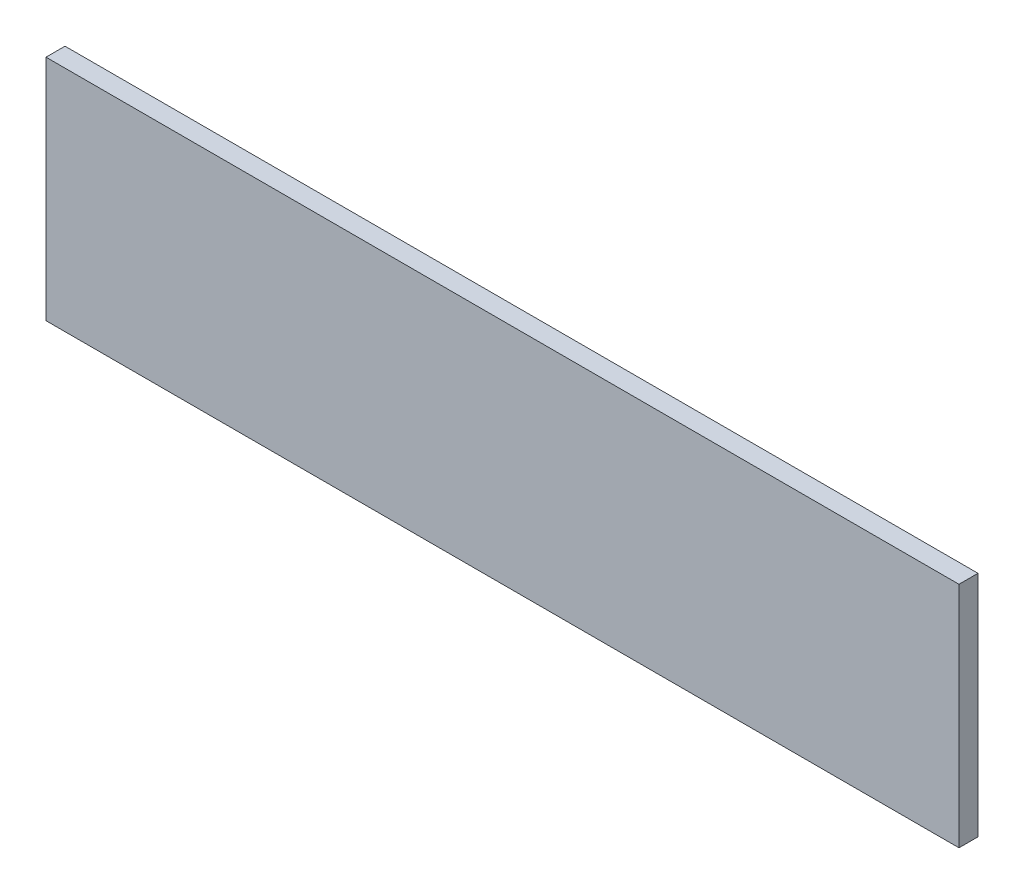
ISO-10303-21;
HEADER;
FILE_DESCRIPTION(('STEP AP214'),'2;1');
FILE_NAME('part.step','',(''),(''),'','','');
FILE_SCHEMA(('AUTOMOTIVE_DESIGN { 1 0 10303 214 1 1 1 1 }'));
ENDSEC;
DATA;
#1=APPLICATION_CONTEXT('core data for automotive mechanical design processes');
#2=APPLICATION_PROTOCOL_DEFINITION('international standard','automotive_design',2000,#1);
#3=PRODUCT_CONTEXT('',#1,'mechanical');
#4=PRODUCT('Part','Part','',(#3));
#5=PRODUCT_RELATED_PRODUCT_CATEGORY('part','',(#4));
#6=PRODUCT_DEFINITION_FORMATION('','',#4);
#7=PRODUCT_DEFINITION_CONTEXT('part definition',#1,'design');
#8=PRODUCT_DEFINITION('design','',#6,#7);
#9=PRODUCT_DEFINITION_SHAPE('','',#8);
#10=(LENGTH_UNIT() NAMED_UNIT(*) SI_UNIT(.MILLI.,.METRE.));
#11=(NAMED_UNIT(*) PLANE_ANGLE_UNIT() SI_UNIT($,.RADIAN.));
#12=(NAMED_UNIT(*) SI_UNIT($,.STERADIAN.) SOLID_ANGLE_UNIT());
#13=UNCERTAINTY_MEASURE_WITH_UNIT(LENGTH_MEASURE(1.E-05),#10,'distance_accuracy_value','');
#14=(GEOMETRIC_REPRESENTATION_CONTEXT(3) GLOBAL_UNCERTAINTY_ASSIGNED_CONTEXT((#13)) GLOBAL_UNIT_ASSIGNED_CONTEXT((#10,
#11,#12)) REPRESENTATION_CONTEXT('',''));
#15=CARTESIAN_POINT('',(0.,0.,0.));
#16=DIRECTION('',(0.,0.,1.));
#17=DIRECTION('',(1.,0.,0.));
#18=AXIS2_PLACEMENT_3D('',#15,#16,#17);
#19=CARTESIAN_POINT('',(-395.555057622941,0.,38.1));
#20=DIRECTION('',(0.,-1.,0.));
#21=DIRECTION('',(0.,0.,-1.));
#22=AXIS2_PLACEMENT_3D('',#19,#20,#21);
#23=PLANE('',#22);
#24=DIRECTION('',(-1.,0.,0.));
#25=VECTOR('',#24,1.);
#26=CARTESIAN_POINT('',(-395.555057622941,0.,0.));
#27=LINE('',#26,#25);
#28=CARTESIAN_POINT('',(0.,0.,0.));
#29=VERTEX_POINT('',#28);
#30=CARTESIAN_POINT('',(-1828.8,-1.66533453693773E-13,0.));
#31=VERTEX_POINT('',#30);
#32=EDGE_CURVE('E101',#29,#31,#27,.T.);
#33=ORIENTED_EDGE('',*,*,#32,.F.);
#34=DIRECTION('',(0.,0.,-1.));
#35=VECTOR('',#34,1.);
#36=CARTESIAN_POINT('',(0.,0.,38.1));
#37=LINE('',#36,#35);
#38=CARTESIAN_POINT('',(0.,0.,38.1));
#39=VERTEX_POINT('',#38);
#40=EDGE_CURVE('E10',#39,#29,#37,.T.);
#41=ORIENTED_EDGE('',*,*,#40,.F.);
#42=DIRECTION('',(-1.,0.,0.));
#43=VECTOR('',#42,1.);
#44=CARTESIAN_POINT('',(-395.555057622941,0.,38.1));
#45=LINE('',#44,#43);
#46=CARTESIAN_POINT('',(-1828.8,-1.66533453693773E-13,38.1));
#47=VERTEX_POINT('',#46);
#48=EDGE_CURVE('E79',#39,#47,#45,.T.);
#49=ORIENTED_EDGE('',*,*,#48,.T.);
#50=DIRECTION('',(0.,0.,-1.));
#51=VECTOR('',#50,1.);
#52=CARTESIAN_POINT('',(-1828.8,-1.66533453693773E-13,38.1));
#53=LINE('',#52,#51);
#54=EDGE_CURVE('E38',#47,#31,#53,.T.);
#55=ORIENTED_EDGE('',*,*,#54,.T.);
#56=EDGE_LOOP('',(#33,#41,#49,#55));
#57=FACE_BOUND('',#56,.T.);
#58=ADVANCED_FACE('F16',(#57),#23,.T.);
#59=CARTESIAN_POINT('',(0.,228.6,38.1));
#60=DIRECTION('',(-1.,0.,0.));
#61=DIRECTION('',(0.,0.,1.));
#62=AXIS2_PLACEMENT_3D('',#59,#60,#61);
#63=PLANE('',#62);
#64=DIRECTION('',(0.,1.,0.));
#65=VECTOR('',#64,1.);
#66=CARTESIAN_POINT('',(0.,228.6,0.));
#67=LINE('',#66,#65);
#68=CARTESIAN_POINT('',(0.,457.2,0.));
#69=VERTEX_POINT('',#68);
#70=EDGE_CURVE('E86',#29,#69,#67,.T.);
#71=ORIENTED_EDGE('',*,*,#70,.T.);
#72=DIRECTION('',(0.,0.,-1.));
#73=VECTOR('',#72,1.);
#74=CARTESIAN_POINT('',(0.,457.2,38.1));
#75=LINE('',#74,#73);
#76=CARTESIAN_POINT('',(0.,457.2,38.1));
#77=VERTEX_POINT('',#76);
#78=EDGE_CURVE('E25',#77,#69,#75,.T.);
#79=ORIENTED_EDGE('',*,*,#78,.F.);
#80=DIRECTION('',(0.,1.,0.));
#81=VECTOR('',#80,1.);
#82=CARTESIAN_POINT('',(0.,228.6,38.1));
#83=LINE('',#82,#81);
#84=EDGE_CURVE('E73',#39,#77,#83,.T.);
#85=ORIENTED_EDGE('',*,*,#84,.F.);
#86=ORIENTED_EDGE('',*,*,#40,.T.);
#87=EDGE_LOOP('',(#71,#79,#85,#86));
#88=FACE_BOUND('',#87,.T.);
#89=ADVANCED_FACE('F84',(#88),#63,.F.);
#90=CARTESIAN_POINT('',(-395.555057622941,457.2,38.1));
#91=DIRECTION('',(0.,-1.,0.));
#92=DIRECTION('',(0.,0.,-1.));
#93=AXIS2_PLACEMENT_3D('',#90,#91,#92);
#94=PLANE('',#93);
#95=DIRECTION('',(-1.,0.,0.));
#96=VECTOR('',#95,1.);
#97=CARTESIAN_POINT('',(-395.555057622941,457.2,0.));
#98=LINE('',#97,#96);
#99=CARTESIAN_POINT('',(-1828.8,457.2,0.));
#100=VERTEX_POINT('',#99);
#101=EDGE_CURVE('E105',#69,#100,#98,.T.);
#102=ORIENTED_EDGE('',*,*,#101,.T.);
#103=DIRECTION('',(0.,0.,-1.));
#104=VECTOR('',#103,1.);
#105=CARTESIAN_POINT('',(-1828.8,457.2,38.1));
#106=LINE('',#105,#104);
#107=CARTESIAN_POINT('',(-1828.8,457.2,38.1));
#108=VERTEX_POINT('',#107);
#109=EDGE_CURVE('E57',#108,#100,#106,.T.);
#110=ORIENTED_EDGE('',*,*,#109,.F.);
#111=DIRECTION('',(-1.,0.,0.));
#112=VECTOR('',#111,1.);
#113=CARTESIAN_POINT('',(-395.555057622941,457.2,38.1));
#114=LINE('',#113,#112);
#115=EDGE_CURVE('E78',#77,#108,#114,.T.);
#116=ORIENTED_EDGE('',*,*,#115,.F.);
#117=ORIENTED_EDGE('',*,*,#78,.T.);
#118=EDGE_LOOP('',(#102,#110,#116,#117));
#119=FACE_BOUND('',#118,.T.);
#120=ADVANCED_FACE('F90',(#119),#94,.F.);
#121=CARTESIAN_POINT('',(-1828.8,228.6,38.1));
#122=DIRECTION('',(-1.,0.,0.));
#123=DIRECTION('',(0.,-1.,0.));
#124=AXIS2_PLACEMENT_3D('',#121,#122,#123);
#125=PLANE('',#124);
#126=DIRECTION('',(0.,1.,0.));
#127=VECTOR('',#126,1.);
#128=CARTESIAN_POINT('',(-1828.8,228.6,0.));
#129=LINE('',#128,#127);
#130=EDGE_CURVE('E107',#31,#100,#129,.T.);
#131=ORIENTED_EDGE('',*,*,#130,.F.);
#132=ORIENTED_EDGE('',*,*,#54,.F.);
#133=DIRECTION('',(0.,1.,0.));
#134=VECTOR('',#133,1.);
#135=CARTESIAN_POINT('',(-1828.8,228.6,38.1));
#136=LINE('',#135,#134);
#137=EDGE_CURVE('E92',#47,#108,#136,.T.);
#138=ORIENTED_EDGE('',*,*,#137,.T.);
#139=ORIENTED_EDGE('',*,*,#109,.T.);
#140=EDGE_LOOP('',(#131,#132,#138,#139));
#141=FACE_BOUND('',#140,.T.);
#142=ADVANCED_FACE('F122',(#141),#125,.T.);
#143=CARTESIAN_POINT('',(-914.4,228.6,38.1));
#144=DIRECTION('',(0.,0.,1.));
#145=DIRECTION('',(1.,0.,0.));
#146=AXIS2_PLACEMENT_3D('',#143,#144,#145);
#147=PLANE('',#146);
#148=ORIENTED_EDGE('',*,*,#48,.F.);
#149=ORIENTED_EDGE('',*,*,#84,.T.);
#150=ORIENTED_EDGE('',*,*,#115,.T.);
#151=ORIENTED_EDGE('',*,*,#137,.F.);
#152=EDGE_LOOP('',(#148,#149,#150,#151));
#153=FACE_BOUND('',#152,.T.);
#154=ADVANCED_FACE('F75',(#153),#147,.T.);
#155=CARTESIAN_POINT('',(-914.4,228.6,0.));
#156=DIRECTION('',(0.,0.,1.));
#157=DIRECTION('',(1.,0.,0.));
#158=AXIS2_PLACEMENT_3D('',#155,#156,#157);
#159=PLANE('',#158);
#160=ORIENTED_EDGE('',*,*,#32,.T.);
#161=ORIENTED_EDGE('',*,*,#130,.T.);
#162=ORIENTED_EDGE('',*,*,#101,.F.);
#163=ORIENTED_EDGE('',*,*,#70,.F.);
#164=EDGE_LOOP('',(#160,#161,#162,#163));
#165=FACE_BOUND('',#164,.T.);
#166=ADVANCED_FACE('F129',(#165),#159,.F.);
#167=CLOSED_SHELL('',(#58,#89,#120,#142,#154,#166));
#168=MANIFOLD_SOLID_BREP('B1',#167);
#169=ADVANCED_BREP_SHAPE_REPRESENTATION('',(#18,#168),#14);
#170=SHAPE_DEFINITION_REPRESENTATION(#9,#169);
ENDSEC;
END-ISO-10303-21;
